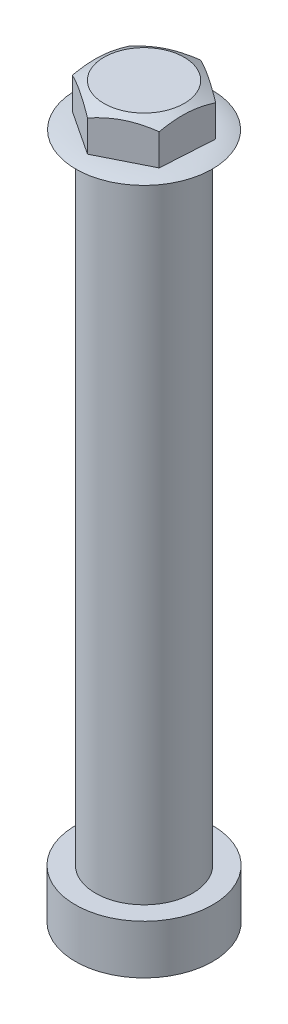
ISO-10303-21;
HEADER;
FILE_DESCRIPTION(('STEP AP214'),'2;1');
FILE_NAME('part.step','',(''),(''),'','','');
FILE_SCHEMA(('AUTOMOTIVE_DESIGN { 1 0 10303 214 1 1 1 1 }'));
ENDSEC;
DATA;
#1=APPLICATION_CONTEXT('core data for automotive mechanical design processes');
#2=APPLICATION_PROTOCOL_DEFINITION('international standard','automotive_design',2000,#1);
#3=PRODUCT_CONTEXT('',#1,'mechanical');
#4=PRODUCT('Part','Part','',(#3));
#5=PRODUCT_RELATED_PRODUCT_CATEGORY('part','',(#4));
#6=PRODUCT_DEFINITION_FORMATION('','',#4);
#7=PRODUCT_DEFINITION_CONTEXT('part definition',#1,'design');
#8=PRODUCT_DEFINITION('design','',#6,#7);
#9=PRODUCT_DEFINITION_SHAPE('','',#8);
#10=(LENGTH_UNIT() NAMED_UNIT(*) SI_UNIT(.MILLI.,.METRE.));
#11=(NAMED_UNIT(*) PLANE_ANGLE_UNIT() SI_UNIT($,.RADIAN.));
#12=(NAMED_UNIT(*) SI_UNIT($,.STERADIAN.) SOLID_ANGLE_UNIT());
#13=UNCERTAINTY_MEASURE_WITH_UNIT(LENGTH_MEASURE(1.E-05),#10,'distance_accuracy_value','');
#14=(GEOMETRIC_REPRESENTATION_CONTEXT(3) GLOBAL_UNCERTAINTY_ASSIGNED_CONTEXT((#13)) GLOBAL_UNIT_ASSIGNED_CONTEXT((#10,
#11,#12)) REPRESENTATION_CONTEXT('',''));
#15=CARTESIAN_POINT('',(0.,0.,0.));
#16=DIRECTION('',(0.,0.,1.));
#17=DIRECTION('',(1.,0.,0.));
#18=AXIS2_PLACEMENT_3D('',#15,#16,#17);
#19=CARTESIAN_POINT('',(0.,11.4007872176338,0.));
#20=DIRECTION('',(0.,-1.,0.));
#21=DIRECTION('',(0.,0.,-1.));
#22=AXIS2_PLACEMENT_3D('',#19,#20,#21);
#23=DEGENERATE_TOROIDAL_SURFACE('',#22,2.34284063875882,3.5316040570822,.T.);
#24=CARTESIAN_POINT('',(1.22850476517504,14.9321428571428,-2.04394333942399));
#25=CARTESIAN_POINT('',(1.23572012334002,14.9321428571428,-2.03960657654142));
#26=CARTESIAN_POINT('',(1.24291251573826,14.9321428571428,-2.03523160408168));
#27=CARTESIAN_POINT('',(1.25725056647514,14.9321428571428,-2.02640573739418));
#28=CARTESIAN_POINT('',(1.26439622481379,14.9321428571428,-2.02195484316642));
#29=CARTESIAN_POINT('',(1.2786400049054,14.9321428571428,-2.01297763032921));
#30=CARTESIAN_POINT('',(1.28573812665837,14.9321428571428,-2.00845131171975));
#31=CARTESIAN_POINT('',(1.2998860377958,14.9321428571428,-1.99932375825669));
#32=CARTESIAN_POINT('',(1.30693582718026,14.9321428571428,-1.99472252340308));
#33=CARTESIAN_POINT('',(1.32098628281266,14.9321428571428,-1.98544565333824));
#34=CARTESIAN_POINT('',(1.32798694906058,14.9321428571428,-1.98077001812701));
#35=CARTESIAN_POINT('',(1.34193837337303,14.9321428571428,-1.97134487189855));
#36=CARTESIAN_POINT('',(1.34888913143755,14.9321428571428,-1.96659536088132));
#37=CARTESIAN_POINT('',(1.36273995949248,14.9321428571428,-1.95702299524813));
#38=CARTESIAN_POINT('',(1.3696400294829,14.9321428571428,-1.95220014063216));
#39=CARTESIAN_POINT('',(1.38338870873702,14.9321428571428,-1.94248163043325));
#40=CARTESIAN_POINT('',(1.39023731800073,14.9321428571428,-1.93758597485032));
#41=CARTESIAN_POINT('',(1.39705981057478,14.9321428571428,-1.93265419009979));
#42=B_SPLINE_CURVE_WITH_KNOTS('',3,(#24,#25,#26,#27,#28,#29,#30,#31,#32,#33,#34,#35,#36,#37,#38,
#39,#40,#41),.UNSPECIFIED.,.F.,.F.,(4,2,2,2,2,2,2,2,4),(0.,0.0252549834235486,
0.0505099668470975,0.0757649502706464,0.101019933694195,0.126274917117744,0.151529900541293,
0.176784883964842,0.20203986738839),.UNSPECIFIED.);
#43=CARTESIAN_POINT('',(1.22850476517504,14.9321428571428,-2.04394333942399));
#44=VERTEX_POINT('',#43);
#45=CARTESIAN_POINT('',(1.39705981057478,14.9321428571428,-1.93265419009979));
#46=VERTEX_POINT('',#45);
#47=EDGE_CURVE('E185',#44,#46,#42,.T.);
#48=ORIENTED_EDGE('',*,*,#47,.T.);
#49=CARTESIAN_POINT('',(0.,14.9321428571428,0.));
#50=DIRECTION('',(0.,-1.,0.));
#51=DIRECTION('',(0.,0.,-1.));
#52=AXIS2_PLACEMENT_3D('',#49,#50,#51);
#53=CIRCLE('',#52,2.38472814652603);
#54=CARTESIAN_POINT('',(2.3843592384247,14.9321428571428,0.0419446655998146));
#55=VERTEX_POINT('',#54);
#56=EDGE_CURVE('E350',#46,#55,#53,.T.);
#57=ORIENTED_EDGE('',*,*,#56,.T.);
#58=CARTESIAN_POINT('',(2.3843592384247,14.9321428571428,0.0419446655998142));
#59=CARTESIAN_POINT('',(2.3842111706807,14.9321428571428,0.050361730509377));
#60=CARTESIAN_POINT('',(2.38401852958882,14.9321428571428,0.0587780112701052));
#61=CARTESIAN_POINT('',(2.38354413019547,14.9321428571428,0.0756080607927467));
#62=CARTESIAN_POINT('',(2.383262371894,14.9321428571428,0.0840218295546601));
#63=CARTESIAN_POINT('',(2.3826097675676,14.9321428571428,0.100845911378526));
#64=CARTESIAN_POINT('',(2.38223892154267,14.9321428571428,0.109256224440479));
#65=CARTESIAN_POINT('',(2.38140818393797,14.9321428571428,0.126072451627514));
#66=CARTESIAN_POINT('',(2.3809482923582,14.9321428571428,0.134478365752596));
#67=CARTESIAN_POINT('',(2.37993951503064,14.9321428571428,0.151284852297416));
#68=CARTESIAN_POINT('',(2.37939062928284,14.9321428571428,0.159685424717155));
#69=CARTESIAN_POINT('',(2.37820392537084,14.9321428571428,0.176480285704941));
#70=CARTESIAN_POINT('',(2.37756610720662,14.9321428571428,0.184874574272989));
#71=CARTESIAN_POINT('',(2.37620160942143,14.9321428571428,0.201655926048611));
#72=CARTESIAN_POINT('',(2.37547492980045,14.9321428571428,0.210042989256185));
#73=CARTESIAN_POINT('',(2.37393279270832,14.9321428571428,0.226808949858193));
#74=CARTESIAN_POINT('',(2.37311733523718,14.9321428571428,0.235187847252625));
#75=CARTESIAN_POINT('',(2.37225753064424,14.9321428571428,0.243562191514153));
#76=B_SPLINE_CURVE_WITH_KNOTS('',3,(#58,#59,#60,#61,#62,#63,#64,#65,#66,#67,#68,#69,#70,#71,#72,
#73,#74,#75),.UNSPECIFIED.,.F.,.F.,(4,2,2,2,2,2,2,2,4),(0.,0.025254983423552,0.0505099668471039,
0.0757649502706558,0.101019933694208,0.12627491711776,0.151529900541312,0.176784883964864,
0.202039867388415),.UNSPECIFIED.);
#77=CARTESIAN_POINT('',(2.37225753064424,14.9321428571428,0.243562191514153));
#78=VERTEX_POINT('',#77);
#79=EDGE_CURVE('E11',#55,#78,#76,.T.);
#80=ORIENTED_EDGE('',*,*,#79,.T.);
#81=CARTESIAN_POINT('',(1.15585447324965,14.9321428571428,2.08588800502382));
#82=VERTEX_POINT('',#81);
#83=EDGE_CURVE('E355',#78,#82,#53,.T.);
#84=ORIENTED_EDGE('',*,*,#83,.T.);
#85=CARTESIAN_POINT('',(1.15585447324965,14.9321428571428,2.08588800502382));
#86=CARTESIAN_POINT('',(1.14849104734067,14.9321428571428,2.08996830705082));
#87=CARTESIAN_POINT('',(1.14110601385056,14.9321428571428,2.0940096153518));
#88=CARTESIAN_POINT('',(1.12629356372033,14.9321428571428,2.10201379818694));
#89=CARTESIAN_POINT('',(1.11886614708021,14.9321428571428,2.10597667272109));
#90=CARTESIAN_POINT('',(1.10396976266219,14.9321428571428,2.11382354170774));
#91=CARTESIAN_POINT('',(1.0965007948843,14.9321428571428,2.11770753616024));
#92=CARTESIAN_POINT('',(1.08152214614217,14.9321428571428,2.1253962098842));
#93=CARTESIAN_POINT('',(1.07401246517793,14.9321428571428,2.12920088915568));
#94=CARTESIAN_POINT('',(1.05895323221798,14.9321428571428,2.13673050563566));
#95=CARTESIAN_POINT('',(1.05140368022226,14.9321428571428,2.14045544284416));
#96=CARTESIAN_POINT('',(1.03626555199781,14.9321428571428,2.14782515760349));
#97=CARTESIAN_POINT('',(1.02867697576908,14.9321428571428,2.1514699351543));
#98=CARTESIAN_POINT('',(1.01346164992895,14.9321428571428,2.15867892129673));
#99=CARTESIAN_POINT('',(1.00583490031756,14.9321428571428,2.16224312988833));
#100=CARTESIAN_POINT('',(0.990544083971311,14.9321428571428,2.16929058029143));
#101=CARTESIAN_POINT('',(0.982880017236457,14.9321428571428,2.17277382210293));
#102=CARTESIAN_POINT('',(0.975197720069472,14.9321428571428,2.17621638161392));
#103=B_SPLINE_CURVE_WITH_KNOTS('',3,(#85,#86,#87,#88,#89,#90,#91,#92,#93,#94,#95,#96,#97,#98,
#99,#100,#101,#102),.UNSPECIFIED.,.F.,.F.,(4,2,2,2,2,2,2,2,4),(0.,0.0252549834235468,
0.0505099668470941,0.0757649502706398,0.101019933694188,0.126274917117734,0.15152990054128,
0.176784883964827,0.202039867388374),.UNSPECIFIED.);
#104=CARTESIAN_POINT('',(0.975197720069473,14.9321428571428,2.17621638161392));
#105=VERTEX_POINT('',#104);
#106=EDGE_CURVE('E49',#82,#105,#103,.T.);
#107=ORIENTED_EDGE('',*,*,#106,.T.);
#108=CARTESIAN_POINT('',(-1.22850476517503,14.9321428571428,2.043943339424));
#109=VERTEX_POINT('',#108);
#110=EDGE_CURVE('E375',#105,#109,#53,.T.);
#111=ORIENTED_EDGE('',*,*,#110,.T.);
#112=CARTESIAN_POINT('',(-1.22850476517503,14.9321428571428,2.043943339424));
#113=CARTESIAN_POINT('',(-1.23572012334001,14.9321428571428,2.03960657654143));
#114=CARTESIAN_POINT('',(-1.24291251573825,14.9321428571428,2.03523160408169));
#115=CARTESIAN_POINT('',(-1.25725056647513,14.9321428571428,2.02640573739419));
#116=CARTESIAN_POINT('',(-1.26439622481378,14.9321428571428,2.02195484316643));
#117=CARTESIAN_POINT('',(-1.27864000490539,14.9321428571428,2.01297763032921));
#118=CARTESIAN_POINT('',(-1.28573812665836,14.9321428571428,2.00845131171976));
#119=CARTESIAN_POINT('',(-1.2998860377958,14.9321428571428,1.99932375825669));
#120=CARTESIAN_POINT('',(-1.30693582718026,14.9321428571428,1.99472252340308));
#121=CARTESIAN_POINT('',(-1.32098628281266,14.9321428571428,1.98544565333824));
#122=CARTESIAN_POINT('',(-1.32798694906058,14.9321428571428,1.98077001812701));
#123=CARTESIAN_POINT('',(-1.34193837337303,14.9321428571428,1.97134487189855));
#124=CARTESIAN_POINT('',(-1.34888913143755,14.9321428571428,1.96659536088132));
#125=CARTESIAN_POINT('',(-1.36273995949249,14.9321428571428,1.95702299524812));
#126=CARTESIAN_POINT('',(-1.3696400294829,14.9321428571428,1.95220014063215));
#127=CARTESIAN_POINT('',(-1.38338870873703,14.9321428571428,1.94248163043325));
#128=CARTESIAN_POINT('',(-1.39023731800073,14.9321428571428,1.93758597485031));
#129=CARTESIAN_POINT('',(-1.39705981057479,14.9321428571428,1.93265419009978));
#130=B_SPLINE_CURVE_WITH_KNOTS('',3,(#112,#113,#114,#115,#116,#117,#118,#119,#120,#121,#122,
#123,#124,#125,#126,#127,#128,#129),.UNSPECIFIED.,.F.,.F.,(4,2,2,2,2,2,2,2,4),(0.,
0.025254983423552,0.0505099668471039,0.0757649502706559,0.101019933694208,0.12627491711776,
0.151529900541312,0.176784883964864,0.202039867388416),.UNSPECIFIED.);
#131=CARTESIAN_POINT('',(-1.39705981057479,14.9321428571428,1.93265419009978));
#132=VERTEX_POINT('',#131);
#133=EDGE_CURVE('E385',#109,#132,#130,.T.);
#134=ORIENTED_EDGE('',*,*,#133,.T.);
#135=CARTESIAN_POINT('',(-2.3843592384247,14.9321428571428,-0.0419446655998146));
#136=VERTEX_POINT('',#135);
#137=EDGE_CURVE('E371',#132,#136,#53,.T.);
#138=ORIENTED_EDGE('',*,*,#137,.T.);
#139=CARTESIAN_POINT('',(-2.3843592384247,14.9321428571428,-0.0419446655998134));
#140=CARTESIAN_POINT('',(-2.3842111706807,14.9321428571428,-0.0503617305093765));
#141=CARTESIAN_POINT('',(-2.38401852958882,14.9321428571428,-0.0587780112701051));
#142=CARTESIAN_POINT('',(-2.38354413019547,14.9321428571428,-0.0756080607927466));
#143=CARTESIAN_POINT('',(-2.383262371894,14.9321428571428,-0.0840218295546596));
#144=CARTESIAN_POINT('',(-2.3826097675676,14.9321428571428,-0.100845911378525));
#145=CARTESIAN_POINT('',(-2.38223892154267,14.9321428571428,-0.109256224440477));
#146=CARTESIAN_POINT('',(-2.38140818393797,14.9321428571428,-0.126072451627512));
#147=CARTESIAN_POINT('',(-2.3809482923582,14.9321428571428,-0.134478365752595));
#148=CARTESIAN_POINT('',(-2.37993951503064,14.9321428571428,-0.151284852297416));
#149=CARTESIAN_POINT('',(-2.37939062928284,14.9321428571428,-0.159685424717155));
#150=CARTESIAN_POINT('',(-2.37820392537084,14.9321428571428,-0.176480285704941));
#151=CARTESIAN_POINT('',(-2.37756610720662,14.9321428571428,-0.184874574272988));
#152=CARTESIAN_POINT('',(-2.37620160942143,14.9321428571428,-0.20165592604861));
#153=CARTESIAN_POINT('',(-2.37547492980045,14.9321428571428,-0.210042989256184));
#154=CARTESIAN_POINT('',(-2.37393279270832,14.9321428571428,-0.226808949858191));
#155=CARTESIAN_POINT('',(-2.37311733523718,14.9321428571428,-0.235187847252624));
#156=CARTESIAN_POINT('',(-2.37225753064424,14.9321428571428,-0.243562191514152));
#157=B_SPLINE_CURVE_WITH_KNOTS('',3,(#139,#140,#141,#142,#143,#144,#145,#146,#147,#148,#149,
#150,#151,#152,#153,#154,#155,#156),.UNSPECIFIED.,.F.,.F.,(4,2,2,2,2,2,2,2,4),(0.,
0.025254983423553,0.0505099668471039,0.0757649502706548,0.101019933694208,0.126274917117761,
0.151529900541312,0.176784883964862,0.202039867388415),.UNSPECIFIED.);
#158=CARTESIAN_POINT('',(-2.37225753064424,14.9321428571428,-0.243562191514153));
#159=VERTEX_POINT('',#158);
#160=EDGE_CURVE('E397',#136,#159,#157,.T.);
#161=ORIENTED_EDGE('',*,*,#160,.T.);
#162=CARTESIAN_POINT('',(-1.15585447324967,14.9321428571428,-2.08588800502381));
#163=VERTEX_POINT('',#162);
#164=EDGE_CURVE('E367',#159,#163,#53,.T.);
#165=ORIENTED_EDGE('',*,*,#164,.T.);
#166=CARTESIAN_POINT('',(-1.15585447324967,14.9321428571428,-2.08588800502381));
#167=CARTESIAN_POINT('',(-1.14849104734068,14.9321428571428,-2.08996830705081));
#168=CARTESIAN_POINT('',(-1.14110601385057,14.9321428571428,-2.0940096153518));
#169=CARTESIAN_POINT('',(-1.12629356372034,14.9321428571428,-2.10201379818694));
#170=CARTESIAN_POINT('',(-1.11886614708022,14.9321428571428,-2.10597667272109));
#171=CARTESIAN_POINT('',(-1.1039697626622,14.9321428571428,-2.11382354170774));
#172=CARTESIAN_POINT('',(-1.09650079488431,14.9321428571428,-2.11770753616023));
#173=CARTESIAN_POINT('',(-1.08152214614217,14.9321428571428,-2.1253962098842));
#174=CARTESIAN_POINT('',(-1.07401246517794,14.9321428571428,-2.12920088915568));
#175=CARTESIAN_POINT('',(-1.05895323221798,14.9321428571428,-2.13673050563566));
#176=CARTESIAN_POINT('',(-1.05140368022226,14.9321428571428,-2.14045544284416));
#177=CARTESIAN_POINT('',(-1.0362655519978,14.9321428571428,-2.14782515760349));
#178=CARTESIAN_POINT('',(-1.02867697576907,14.9321428571428,-2.15146993515431));
#179=CARTESIAN_POINT('',(-1.01346164992894,14.9321428571428,-2.15867892129673));
#180=CARTESIAN_POINT('',(-1.00583490031755,14.9321428571428,-2.16224312988834));
#181=CARTESIAN_POINT('',(-0.990544083971295,14.9321428571428,-2.16929058029144));
#182=CARTESIAN_POINT('',(-0.982880017236439,14.9321428571428,-2.17277382210294));
#183=CARTESIAN_POINT('',(-0.975197720069453,14.9321428571428,-2.17621638161393));
#184=B_SPLINE_CURVE_WITH_KNOTS('',3,(#166,#167,#168,#169,#170,#171,#172,#173,#174,#175,#176,
#177,#178,#179,#180,#181,#182,#183),.UNSPECIFIED.,.F.,.F.,(4,2,2,2,2,2,2,2,4),(0.,
0.0252549834235509,0.0505099668471038,0.0757649502706546,0.101019933694208,0.126274917117761,
0.151529900541312,0.176784883964864,0.202039867388415),.UNSPECIFIED.);
#185=CARTESIAN_POINT('',(-0.975197720069453,14.9321428571428,-2.17621638161393));
#186=VERTEX_POINT('',#185);
#187=EDGE_CURVE('E344',#163,#186,#184,.T.);
#188=ORIENTED_EDGE('',*,*,#187,.T.);
#189=EDGE_CURVE('E181',#186,#44,#53,.T.);
#190=ORIENTED_EDGE('',*,*,#189,.T.);
#191=EDGE_LOOP('',(#48,#57,#80,#84,#107,#111,#134,#138,#161,#165,#188,#190));
#192=FACE_BOUND('',#191,.T.);
#193=CARTESIAN_POINT('',(0.,14.7321428571428,0.));
#194=DIRECTION('',(0.,-1.,0.));
#195=DIRECTION('',(0.,0.,-1.));
#196=AXIS2_PLACEMENT_3D('',#193,#194,#195);
#197=CIRCLE('',#196,3.51514470303165);
#198=CARTESIAN_POINT('',(0.,14.7321428571428,-3.51514470303165));
#199=VERTEX_POINT('',#198);
#200=EDGE_CURVE('E338',#199,#199,#197,.T.);
#201=ORIENTED_EDGE('',*,*,#200,.F.);
#202=EDGE_LOOP('',(#201));
#203=FACE_BOUND('',#202,.T.);
#204=ADVANCED_FACE('F39',(#192,#203),#23,.T.);
#205=CARTESIAN_POINT('',(2.5,14.7321428571428,0.));
#206=DIRECTION('',(0.,-1.,0.));
#207=DIRECTION('',(0.,0.,-1.));
#208=AXIS2_PLACEMENT_3D('',#205,#206,#207);
#209=PLANE('',#208);
#210=ORIENTED_EDGE('',*,*,#200,.T.);
#211=EDGE_LOOP('',(#210));
#212=FACE_BOUND('',#211,.T.);
#213=CARTESIAN_POINT('',(0.,14.7321428571428,0.));
#214=DIRECTION('',(0.,-1.,0.));
#215=DIRECTION('',(0.,0.,-1.));
#216=AXIS2_PLACEMENT_3D('',#213,#214,#215);
#217=CIRCLE('',#216,2.5);
#218=CARTESIAN_POINT('',(0.,14.7321428571428,-2.5));
#219=VERTEX_POINT('',#218);
#220=EDGE_CURVE('E340',#219,#219,#217,.T.);
#221=ORIENTED_EDGE('',*,*,#220,.F.);
#222=EDGE_LOOP('',(#221));
#223=FACE_BOUND('',#222,.T.);
#224=ADVANCED_FACE('F326',(#212,#223),#209,.T.);
#225=CARTESIAN_POINT('',(0.,0.,0.));
#226=DIRECTION('',(0.,-1.,0.));
#227=DIRECTION('',(0.,0.,-1.));
#228=AXIS2_PLACEMENT_3D('',#225,#226,#227);
#229=CYLINDRICAL_SURFACE('',#228,2.5);
#230=ORIENTED_EDGE('',*,*,#220,.T.);
#231=EDGE_LOOP('',(#230));
#232=FACE_BOUND('',#231,.T.);
#233=CARTESIAN_POINT('',(0.,-18.0678571428572,0.));
#234=DIRECTION('',(0.,-1.,0.));
#235=DIRECTION('',(0.,0.,-1.));
#236=AXIS2_PLACEMENT_3D('',#233,#234,#235);
#237=CIRCLE('',#236,2.5);
#238=CARTESIAN_POINT('',(0.,-18.0678571428572,-2.5));
#239=VERTEX_POINT('',#238);
#240=EDGE_CURVE('E346',#239,#239,#237,.T.);
#241=ORIENTED_EDGE('',*,*,#240,.F.);
#242=EDGE_LOOP('',(#241));
#243=FACE_BOUND('',#242,.T.);
#244=ADVANCED_FACE('F331',(#232,#243),#229,.T.);
#245=CARTESIAN_POINT('',(2.5,-18.0678571428572,0.));
#246=DIRECTION('',(0.,1.,0.));
#247=DIRECTION('',(0.,0.,1.));
#248=AXIS2_PLACEMENT_3D('',#245,#246,#247);
#249=PLANE('',#248);
#250=ORIENTED_EDGE('',*,*,#240,.T.);
#251=EDGE_LOOP('',(#250));
#252=FACE_BOUND('',#251,.T.);
#253=CARTESIAN_POINT('',(0.,-18.0678571428572,0.));
#254=DIRECTION('',(0.,-1.,0.));
#255=DIRECTION('',(0.,0.,-1.));
#256=AXIS2_PLACEMENT_3D('',#253,#254,#255);
#257=CIRCLE('',#256,3.53602296334848);
#258=CARTESIAN_POINT('',(0.,-18.0678571428572,-3.53602296334848));
#259=VERTEX_POINT('',#258);
#260=EDGE_CURVE('E461',#259,#259,#257,.T.);
#261=ORIENTED_EDGE('',*,*,#260,.F.);
#262=EDGE_LOOP('',(#261));
#263=FACE_BOUND('',#262,.T.);
#264=ADVANCED_FACE('F468',(#252,#263),#249,.T.);
#265=CARTESIAN_POINT('',(0.,0.,0.));
#266=DIRECTION('',(0.,-1.,0.));
#267=DIRECTION('',(0.,0.,-1.));
#268=AXIS2_PLACEMENT_3D('',#265,#266,#267);
#269=CYLINDRICAL_SURFACE('',#268,3.53602296334848);
#270=ORIENTED_EDGE('',*,*,#260,.T.);
#271=EDGE_LOOP('',(#270));
#272=FACE_BOUND('',#271,.T.);
#273=CARTESIAN_POINT('',(0.,-20.5964207435835,0.));
#274=DIRECTION('',(0.,-1.,0.));
#275=DIRECTION('',(0.,0.,-1.));
#276=AXIS2_PLACEMENT_3D('',#273,#274,#275);
#277=CIRCLE('',#276,3.53602296334848);
#278=CARTESIAN_POINT('',(0.,-20.5964207435835,-3.53602296334848));
#279=VERTEX_POINT('',#278);
#280=EDGE_CURVE('E457',#279,#279,#277,.T.);
#281=ORIENTED_EDGE('',*,*,#280,.F.);
#282=EDGE_LOOP('',(#281));
#283=FACE_BOUND('',#282,.T.);
#284=ADVANCED_FACE('F477',(#272,#283),#269,.T.);
#285=CARTESIAN_POINT('',(3.53602296334848,-20.5964207435835,0.));
#286=DIRECTION('',(0.,-1.,0.));
#287=DIRECTION('',(0.,0.,-1.));
#288=AXIS2_PLACEMENT_3D('',#285,#286,#287);
#289=PLANE('',#288);
#290=ORIENTED_EDGE('',*,*,#280,.T.);
#291=EDGE_LOOP('',(#290));
#292=FACE_BOUND('',#291,.T.);
#293=CARTESIAN_POINT('',(0.,-20.5964207435835,0.));
#294=DIRECTION('',(0.,-1.,0.));
#295=DIRECTION('',(0.,0.,-1.));
#296=AXIS2_PLACEMENT_3D('',#293,#294,#295);
#297=CIRCLE('',#296,1.16788134129855);
#298=CARTESIAN_POINT('',(0.,-20.5964207435835,-1.16788134129855));
#299=VERTEX_POINT('',#298);
#300=EDGE_CURVE('E453',#299,#299,#297,.T.);
#301=ORIENTED_EDGE('',*,*,#300,.F.);
#302=EDGE_LOOP('',(#301));
#303=FACE_BOUND('',#302,.T.);
#304=ADVANCED_FACE('F482',(#292,#303),#289,.T.);
#305=CARTESIAN_POINT('',(0.,0.,0.));
#306=DIRECTION('',(0.,-1.,0.));
#307=DIRECTION('',(0.,0.,-1.));
#308=AXIS2_PLACEMENT_3D('',#305,#306,#307);
#309=CYLINDRICAL_SURFACE('',#308,1.16788134129855);
#310=ORIENTED_EDGE('',*,*,#300,.T.);
#311=EDGE_LOOP('',(#310));
#312=FACE_BOUND('',#311,.T.);
#313=CARTESIAN_POINT('',(0.,-18.729405275402,0.));
#314=DIRECTION('',(0.,-1.,0.));
#315=DIRECTION('',(0.,0.,-1.));
#316=AXIS2_PLACEMENT_3D('',#313,#314,#315);
#317=CIRCLE('',#316,1.16788134129855);
#318=CARTESIAN_POINT('',(0.,-18.729405275402,-1.16788134129855));
#319=VERTEX_POINT('',#318);
#320=EDGE_CURVE('E354',#319,#319,#317,.T.);
#321=ORIENTED_EDGE('',*,*,#320,.F.);
#322=EDGE_LOOP('',(#321));
#323=FACE_BOUND('',#322,.T.);
#324=ADVANCED_FACE('F486',(#312,#323),#309,.F.);
#325=CARTESIAN_POINT('',(0.,-17.5656157835472,0.));
#326=DIRECTION('',(0.,-1.,0.));
#327=DIRECTION('',(0.,0.,-1.));
#328=AXIS2_PLACEMENT_3D('',#325,#326,#327);
#329=CONICAL_SURFACE('',#328,0.,0.787153061724035);
#330=ORIENTED_EDGE('',*,*,#320,.T.);
#331=EDGE_LOOP('',(#330));
#332=FACE_BOUND('',#331,.T.);
#333=CARTESIAN_POINT('',(0.,-17.5656157835472,0.));
#334=VERTEX_POINT('',#333);
#335=VERTEX_LOOP('',#334);
#336=FACE_BOUND('',#335,.T.);
#337=ADVANCED_FACE('F320',(#332,#336),#329,.F.);
#338=CARTESIAN_POINT('',(0.,14.9321428571428,0.));
#339=DIRECTION('',(0.,1.,0.));
#340=DIRECTION('',(0.,0.,1.));
#341=AXIS2_PLACEMENT_3D('',#338,#339,#340);
#342=PLANE('',#341);
#343=ORIENTED_EDGE('',*,*,#56,.F.);
#344=DIRECTION('',(-0.834511930120725,0.,-0.550989871491465));
#345=VECTOR('',#344,1.);
#346=CARTESIAN_POINT('',(2.46072711493959,14.9321428571428,-1.23036355746994));
#347=LINE('',#346,#345);
#348=CARTESIAN_POINT('',(2.46072711493959,14.9321428571428,-1.23036355746994));
#349=VERTEX_POINT('',#348);
#350=EDGE_CURVE('E64',#349,#46,#347,.T.);
#351=ORIENTED_EDGE('',*,*,#350,.F.);
#352=DIRECTION('',(0.0599152608791697,0.,-0.998203466991465));
#353=VECTOR('',#352,1.);
#354=CARTESIAN_POINT('',(2.29588965412935,14.9321428571428,1.51587041458391));
#355=LINE('',#354,#353);
#356=EDGE_CURVE('E150',#55,#349,#355,.T.);
#357=ORIENTED_EDGE('',*,*,#356,.F.);
#358=EDGE_LOOP('',(#343,#351,#357));
#359=FACE_BOUND('',#358,.T.);
#360=ADVANCED_FACE('F314',(#359),#342,.F.);
#361=ORIENTED_EDGE('',*,*,#83,.F.);
#362=CARTESIAN_POINT('',(2.29588965412935,14.9321428571428,1.51587041458391));
#363=VERTEX_POINT('',#362);
#364=EDGE_CURVE('E434',#363,#78,#355,.T.);
#365=ORIENTED_EDGE('',*,*,#364,.F.);
#366=DIRECTION('',(0.894427190999895,0.,-0.4472135955));
#367=VECTOR('',#366,1.);
#368=CARTESIAN_POINT('',(-0.164837460810232,14.9321428571428,2.74623397205384));
#369=LINE('',#368,#367);
#370=EDGE_CURVE('E155',#82,#363,#369,.T.);
#371=ORIENTED_EDGE('',*,*,#370,.F.);
#372=EDGE_LOOP('',(#361,#365,#371));
#373=FACE_BOUND('',#372,.T.);
#374=ADVANCED_FACE('F319',(#373),#342,.F.);
#375=ORIENTED_EDGE('',*,*,#110,.F.);
#376=CARTESIAN_POINT('',(-0.164837460810232,14.9321428571428,2.74623397205384));
#377=VERTEX_POINT('',#376);
#378=EDGE_CURVE('E159',#377,#105,#369,.T.);
#379=ORIENTED_EDGE('',*,*,#378,.F.);
#380=DIRECTION('',(0.834511930120725,0.,0.550989871491466));
#381=VECTOR('',#380,1.);
#382=CARTESIAN_POINT('',(-2.46072711493959,14.9321428571428,1.23036355746994));
#383=LINE('',#382,#381);
#384=EDGE_CURVE('E282',#109,#377,#383,.T.);
#385=ORIENTED_EDGE('',*,*,#384,.F.);
#386=EDGE_LOOP('',(#375,#379,#385));
#387=FACE_BOUND('',#386,.T.);
#388=ADVANCED_FACE('F509',(#387),#342,.F.);
#389=ORIENTED_EDGE('',*,*,#137,.F.);
#390=CARTESIAN_POINT('',(-2.46072711493959,14.9321428571428,1.23036355746994));
#391=VERTEX_POINT('',#390);
#392=EDGE_CURVE('E292',#391,#132,#383,.T.);
#393=ORIENTED_EDGE('',*,*,#392,.F.);
#394=DIRECTION('',(-0.0599152608791697,0.,0.998203466991465));
#395=VECTOR('',#394,1.);
#396=CARTESIAN_POINT('',(-2.29588965412935,14.9321428571428,-1.5158704145839));
#397=LINE('',#396,#395);
#398=EDGE_CURVE('E283',#136,#391,#397,.T.);
#399=ORIENTED_EDGE('',*,*,#398,.F.);
#400=EDGE_LOOP('',(#389,#393,#399));
#401=FACE_BOUND('',#400,.T.);
#402=ADVANCED_FACE('F323',(#401),#342,.F.);
#403=ORIENTED_EDGE('',*,*,#164,.F.);
#404=CARTESIAN_POINT('',(-2.29588965412935,14.9321428571428,-1.5158704145839));
#405=VERTEX_POINT('',#404);
#406=EDGE_CURVE('E272',#405,#159,#397,.T.);
#407=ORIENTED_EDGE('',*,*,#406,.F.);
#408=DIRECTION('',(-0.894427190999895,0.,0.4472135955));
#409=VECTOR('',#408,1.);
#410=CARTESIAN_POINT('',(0.164837460810233,14.9321428571428,-2.74623397205384));
#411=LINE('',#410,#409);
#412=EDGE_CURVE('E416',#163,#405,#411,.T.);
#413=ORIENTED_EDGE('',*,*,#412,.F.);
#414=EDGE_LOOP('',(#403,#407,#413));
#415=FACE_BOUND('',#414,.T.);
#416=ADVANCED_FACE('F315',(#415),#342,.F.);
#417=CARTESIAN_POINT('',(2.29588965412935,16.9321428571428,1.51587041458391));
#418=DIRECTION('',(-0.998203466991465,0.,-0.0599152608791697));
#419=DIRECTION('',(-0.0599152608791697,0.,0.998203466991465));
#420=AXIS2_PLACEMENT_3D('',#417,#418,#419);
#421=PLANE('',#420);
#422=DIRECTION('',(0.,-1.,0.));
#423=VECTOR('',#422,1.);
#424=CARTESIAN_POINT('',(2.46072711493959,16.9321428571428,-1.23036355746994));
#425=LINE('',#424,#423);
#426=CARTESIAN_POINT('',(2.46072711493959,16.548897812025,-1.23036355746994));
#427=VERTEX_POINT('',#426);
#428=EDGE_CURVE('E148',#427,#349,#425,.T.);
#429=ORIENTED_EDGE('',*,*,#428,.F.);
#430=CARTESIAN_POINT('',(2.46074062013582,16.5488348896727,-1.23058855746994));
#431=CARTESIAN_POINT('',(2.45351773846385,16.5824995592111,-1.11025351392965));
#432=CARTESIAN_POINT('',(2.44623656720168,16.6131060458605,-0.988947351008785));
#433=CARTESIAN_POINT('',(2.43155665401806,16.6665431283379,-0.744376268115911));
#434=CARTESIAN_POINT('',(2.42415768737687,16.6893563481994,-0.621107604256018));
#435=CARTESIAN_POINT('',(2.40944542423664,16.7249663791817,-0.375997562868022));
#436=CARTESIAN_POINT('',(2.40213410317757,16.7379826147535,-0.254189096671587));
#437=CARTESIAN_POINT('',(2.3874787329988,16.7536496113539,-0.010026906474475));
#438=CARTESIAN_POINT('',(2.38013473007279,16.7563120425379,0.112326047927611));
#439=CARTESIAN_POINT('',(2.36635881858302,16.7513680119346,0.341836232950327));
#440=CARTESIAN_POINT('',(2.3599252004034,16.7449775384176,0.449021946205315));
#441=CARTESIAN_POINT('',(2.34709701847895,16.7245243463655,0.662742715910516));
#442=CARTESIAN_POINT('',(2.3407024931917,16.7104550172392,0.769277131647561));
#443=CARTESIAN_POINT('',(2.32784900808918,16.6752069801691,0.98341945872739));
#444=CARTESIAN_POINT('',(2.32139148473815,16.653886155346,1.09100343821094));
#445=CARTESIAN_POINT('',(2.30856705489035,16.6054276250369,1.304661697366));
#446=CARTESIAN_POINT('',(2.30220000436534,16.578300620446,1.41073837658452));
#447=CARTESIAN_POINT('',(2.29587614893313,16.5488348896727,1.51609541458391));
#448=B_SPLINE_CURVE_WITH_KNOTS('',3,(#430,#431,#432,#433,#434,#435,#436,#437,#438,#439,#440,
#441,#442,#443,#444,#445,#446,#447),.UNSPECIFIED.,.F.,.F.,(4,2,2,2,2,2,2,2,4),(0.,
0.375625839130045,0.752083794239729,1.11983638075704,1.48717433940027,1.80958971439268,
2.13228308989451,2.4617047501517,2.79052442924564),.UNSPECIFIED.);
#449=CARTESIAN_POINT('',(2.29588965412935,16.548897812025,1.51587041458391));
#450=VERTEX_POINT('',#449);
#451=EDGE_CURVE('E134',#427,#450,#448,.T.);
#452=ORIENTED_EDGE('',*,*,#451,.T.);
#453=DIRECTION('',(0.,-1.,0.));
#454=VECTOR('',#453,1.);
#455=CARTESIAN_POINT('',(2.29588965412935,16.9321428571428,1.51587041458391));
#456=LINE('',#455,#454);
#457=EDGE_CURVE('E145',#450,#363,#456,.T.);
#458=ORIENTED_EDGE('',*,*,#457,.T.);
#459=ORIENTED_EDGE('',*,*,#364,.T.);
#460=ORIENTED_EDGE('',*,*,#79,.F.);
#461=ORIENTED_EDGE('',*,*,#356,.T.);
#462=EDGE_LOOP('',(#429,#452,#458,#459,#460,#461));
#463=FACE_BOUND('',#462,.T.);
#464=ADVANCED_FACE('F143',(#463),#421,.F.);
#465=CARTESIAN_POINT('',(2.46072711493959,16.9321428571428,-1.23036355746994));
#466=DIRECTION('',(-0.550989871491465,0.,0.834511930120725));
#467=DIRECTION('',(0.834511930120725,0.,0.550989871491465));
#468=AXIS2_PLACEMENT_3D('',#465,#466,#467);
#469=PLANE('',#468);
#470=DIRECTION('',(0.,-1.,0.));
#471=VECTOR('',#470,1.);
#472=CARTESIAN_POINT('',(0.164837460810233,16.9321428571428,-2.74623397205384));
#473=LINE('',#472,#471);
#474=CARTESIAN_POINT('',(0.164837460810233,16.548897812025,-2.74623397205384));
#475=VERTEX_POINT('',#474);
#476=CARTESIAN_POINT('',(0.164837460810233,14.9321428571428,-2.74623397205384));
#477=VERTEX_POINT('',#476);
#478=EDGE_CURVE('E176',#475,#477,#473,.T.);
#479=ORIENTED_EDGE('',*,*,#478,.F.);
#480=CARTESIAN_POINT('',(0.164612460810233,16.5488225463938,-2.74638252921236));
#481=CARTESIAN_POINT('',(0.265214857842401,16.5824882310912,-2.67995939035505));
#482=CARTESIAN_POINT('',(0.366629128392834,16.6130957938479,-2.61300020872909));
#483=CARTESIAN_POINT('',(0.571095274881091,16.6665351053309,-2.47800060990775));
#484=CARTESIAN_POINT('',(0.674150281101777,16.6893494768121,-2.40995812593047));
#485=CARTESIAN_POINT('',(0.879067036635421,16.7249617842721,-2.27466101066743));
#486=CARTESIAN_POINT('',(0.980901269234312,16.7379791512476,-2.20742454740323));
#487=CARTESIAN_POINT('',(1.18502564826106,16.7536483335288,-2.07265060192835));
#488=CARTESIAN_POINT('',(1.28731515116313,16.7563118198308,-2.00511354460817));
#489=CARTESIAN_POINT('',(1.47919507451841,16.7513694723044,-1.87842405043159));
#490=CARTESIAN_POINT('',(1.56880928991213,16.7449792138229,-1.81925590286964));
#491=CARTESIAN_POINT('',(1.74749372198435,16.7245254803085,-1.70127878509403));
#492=CARTESIAN_POINT('',(1.83656340286656,16.7104553926169,-1.64247016864205));
#493=CARTESIAN_POINT('',(2.015600368112,16.675204978537,-1.52426028941536));
#494=CARTESIAN_POINT('',(2.10554764084326,16.6538825061975,-1.46487223940146));
#495=CARTESIAN_POINT('',(2.28417987817075,16.6054200477468,-1.34692958341682));
#496=CARTESIAN_POINT('',(2.37286684940766,16.578290765456,-1.28837365255347));
#497=CARTESIAN_POINT('',(2.46095211493959,16.5488225463938,-1.23021500031142));
#498=B_SPLINE_CURVE_WITH_KNOTS('',3,(#480,#481,#482,#483,#484,#485,#486,#487,#488,#489,#490,
#491,#492,#493,#494,#495,#496,#497),.UNSPECIFIED.,.F.,.F.,(4,2,2,2,2,2,2,2,4),(0.,
0.375628854657246,0.752089900504497,1.11984523143295,1.4871859045232,1.80962082527482,
2.13233381513885,2.46177606628871,2.79061620013184),.UNSPECIFIED.);
#499=EDGE_CURVE('E151',#475,#427,#498,.T.);
#500=ORIENTED_EDGE('',*,*,#499,.T.);
#501=ORIENTED_EDGE('',*,*,#428,.T.);
#502=ORIENTED_EDGE('',*,*,#350,.T.);
#503=ORIENTED_EDGE('',*,*,#47,.F.);
#504=EDGE_CURVE('E421',#44,#477,#347,.T.);
#505=ORIENTED_EDGE('',*,*,#504,.T.);
#506=EDGE_LOOP('',(#479,#500,#501,#502,#503,#505));
#507=FACE_BOUND('',#506,.T.);
#508=ADVANCED_FACE('F193',(#507),#469,.F.);
#509=CARTESIAN_POINT('',(0.164837460810233,16.9321428571428,-2.74623397205384));
#510=DIRECTION('',(0.4472135955,0.,0.894427190999895));
#511=DIRECTION('',(0.894427190999895,0.,-0.4472135955));
#512=AXIS2_PLACEMENT_3D('',#509,#510,#511);
#513=PLANE('',#512);
#514=DIRECTION('',(0.,-1.,0.));
#515=VECTOR('',#514,1.);
#516=CARTESIAN_POINT('',(-2.29588965412935,16.9321428571428,-1.5158704145839));
#517=LINE('',#516,#515);
#518=CARTESIAN_POINT('',(-2.29588965412935,16.548897812025,-1.5158704145839));
#519=VERTEX_POINT('',#518);
#520=EDGE_CURVE('E173',#519,#405,#517,.T.);
#521=ORIENTED_EDGE('',*,*,#520,.F.);
#522=CARTESIAN_POINT('',(-2.29611465412935,16.5488275885808,-1.5157579145839));
#523=CARTESIAN_POINT('',(-2.18828960719348,16.5824928585926,-1.56967043805185));
#524=CARTESIAN_POINT('',(-2.07959439870813,16.6130999817669,-1.62401804229453));
#525=CARTESIAN_POINT('',(-1.86044882668239,16.666538382716,-1.73359082830741));
#526=CARTESIAN_POINT('',(-1.74999510826411,16.689352283768,-1.78881768751656));
#527=CARTESIAN_POINT('',(-1.53036658904941,16.7249636613013,-1.89863194712392));
#528=CARTESIAN_POINT('',(-1.42122127953413,16.7379805661053,-1.95320460188157));
#529=CARTESIAN_POINT('',(-1.20244204450993,16.7536488555484,-2.06259421939368));
#530=CARTESIAN_POINT('',(-1.09280880867265,16.7563119108403,-2.11741083731233));
#531=CARTESIAN_POINT('',(-0.887155253594545,16.7513688757741,-2.22023761485139));
#532=CARTESIAN_POINT('',(-0.791109423598891,16.7449785294429,-2.26826052984922));
#533=CARTESIAN_POINT('',(-0.59960080189342,16.7245250171019,-2.36401484070197));
#534=CARTESIAN_POINT('',(-0.504138584382132,16.7104552392781,-2.41174594945762));
#535=CARTESIAN_POINT('',(-0.312252164894284,16.6752057961946,-2.50768915920155));
#536=CARTESIAN_POINT('',(-0.215849409452376,16.65388399686,-2.55589053692251));
#537=CARTESIAN_POINT('',(-0.0243967583402544,16.6054231430426,-2.65161686247859));
#538=CARTESIAN_POINT('',(0.0706552877843215,16.5782947911854,-2.69914288554088));
#539=CARTESIAN_POINT('',(0.165062460810233,16.5488275885808,-2.74634647205384));
#540=B_SPLINE_CURVE_WITH_KNOTS('',3,(#522,#523,#524,#525,#526,#527,#528,#529,#530,#531,#532,
#533,#534,#535,#536,#537,#538,#539),.UNSPECIFIED.,.F.,.F.,(4,2,2,2,2,2,2,2,4),(0.,
0.375627622825259,0.752087406117356,1.11984161596317,1.48718118021109,1.80960811665279,
2.13231309418183,2.46174693408067,2.79057871228882),.UNSPECIFIED.);
#541=EDGE_CURVE('E217',#519,#475,#540,.T.);
#542=ORIENTED_EDGE('',*,*,#541,.T.);
#543=ORIENTED_EDGE('',*,*,#478,.T.);
#544=EDGE_CURVE('E419',#477,#186,#411,.T.);
#545=ORIENTED_EDGE('',*,*,#544,.T.);
#546=ORIENTED_EDGE('',*,*,#187,.F.);
#547=ORIENTED_EDGE('',*,*,#412,.T.);
#548=EDGE_LOOP('',(#521,#542,#543,#545,#546,#547));
#549=FACE_BOUND('',#548,.T.);
#550=ADVANCED_FACE('F203',(#549),#513,.F.);
#551=CARTESIAN_POINT('',(-2.29588965412935,16.9321428571428,-1.5158704145839));
#552=DIRECTION('',(0.998203466991465,0.,0.0599152608791697));
#553=DIRECTION('',(0.0599152608791697,0.,-0.998203466991465));
#554=AXIS2_PLACEMENT_3D('',#551,#552,#553);
#555=PLANE('',#554);
#556=DIRECTION('',(0.,-1.,0.));
#557=VECTOR('',#556,1.);
#558=CARTESIAN_POINT('',(-2.46072711493959,16.9321428571428,1.23036355746994));
#559=LINE('',#558,#557);
#560=CARTESIAN_POINT('',(-2.46072711493959,16.548897812025,1.23036355746994));
#561=VERTEX_POINT('',#560);
#562=EDGE_CURVE('E163',#561,#391,#559,.T.);
#563=ORIENTED_EDGE('',*,*,#562,.F.);
#564=CARTESIAN_POINT('',(-2.46074062013582,16.5488348896727,1.23058855746994));
#565=CARTESIAN_POINT('',(-2.45351773846385,16.5824995592111,1.11025351392965));
#566=CARTESIAN_POINT('',(-2.44623656720168,16.6131060458605,0.988947351008784));
#567=CARTESIAN_POINT('',(-2.43155665401806,16.6665431283379,0.74437626811591));
#568=CARTESIAN_POINT('',(-2.42415768737687,16.6893563481994,0.621107604256017));
#569=CARTESIAN_POINT('',(-2.40944542423664,16.7249663791817,0.375997562868021));
#570=CARTESIAN_POINT('',(-2.40213410317757,16.7379826147535,0.254189096671586));
#571=CARTESIAN_POINT('',(-2.3874787329988,16.7536496113539,0.0100269064744739));
#572=CARTESIAN_POINT('',(-2.38013473007279,16.7563120425379,-0.112326047927612));
#573=CARTESIAN_POINT('',(-2.36635881858302,16.7513680119346,-0.341836232950328));
#574=CARTESIAN_POINT('',(-2.3599252004034,16.7449775384176,-0.449021946205316));
#575=CARTESIAN_POINT('',(-2.34709701847895,16.7245243463655,-0.662742715910517));
#576=CARTESIAN_POINT('',(-2.3407024931917,16.7104550172392,-0.769277131647561));
#577=CARTESIAN_POINT('',(-2.32784900808918,16.6752069801691,-0.98341945872739));
#578=CARTESIAN_POINT('',(-2.32139148473815,16.653886155346,-1.09100343821094));
#579=CARTESIAN_POINT('',(-2.30856705489035,16.6054276250369,-1.304661697366));
#580=CARTESIAN_POINT('',(-2.30220000436534,16.578300620446,-1.41073837658452));
#581=CARTESIAN_POINT('',(-2.29587614893313,16.5488348896727,-1.5160954145839));
#582=B_SPLINE_CURVE_WITH_KNOTS('',3,(#564,#565,#566,#567,#568,#569,#570,#571,#572,#573,#574,
#575,#576,#577,#578,#579,#580,#581),.UNSPECIFIED.,.F.,.F.,(4,2,2,2,2,2,2,2,4),(0.,
0.375625839130044,0.752083794239729,1.11983638075704,1.48717433940027,1.80958971439268,
2.13228308989451,2.4617047501517,2.79052442924564),.UNSPECIFIED.);
#583=EDGE_CURVE('E251',#561,#519,#582,.T.);
#584=ORIENTED_EDGE('',*,*,#583,.T.);
#585=ORIENTED_EDGE('',*,*,#520,.T.);
#586=ORIENTED_EDGE('',*,*,#406,.T.);
#587=ORIENTED_EDGE('',*,*,#160,.F.);
#588=ORIENTED_EDGE('',*,*,#398,.T.);
#589=EDGE_LOOP('',(#563,#584,#585,#586,#587,#588));
#590=FACE_BOUND('',#589,.T.);
#591=ADVANCED_FACE('F258',(#590),#555,.F.);
#592=CARTESIAN_POINT('',(-2.46072711493959,16.9321428571428,1.23036355746994));
#593=DIRECTION('',(0.550989871491466,0.,-0.834511930120725));
#594=DIRECTION('',(-0.834511930120725,0.,-0.550989871491466));
#595=AXIS2_PLACEMENT_3D('',#592,#593,#594);
#596=PLANE('',#595);
#597=DIRECTION('',(0.,-1.,0.));
#598=VECTOR('',#597,1.);
#599=CARTESIAN_POINT('',(-0.164837460810232,16.9321428571428,2.74623397205384));
#600=LINE('',#599,#598);
#601=CARTESIAN_POINT('',(-0.164837460810232,16.548897812025,2.74623397205384));
#602=VERTEX_POINT('',#601);
#603=EDGE_CURVE('E158',#602,#377,#600,.T.);
#604=ORIENTED_EDGE('',*,*,#603,.F.);
#605=CARTESIAN_POINT('',(-0.164612460810231,16.5488225463938,2.74638252921236));
#606=CARTESIAN_POINT('',(-0.265214857842399,16.5824882310912,2.67995939035505));
#607=CARTESIAN_POINT('',(-0.366629128392833,16.6130957938479,2.61300020872909));
#608=CARTESIAN_POINT('',(-0.57109527488109,16.6665351053309,2.47800060990775));
#609=CARTESIAN_POINT('',(-0.674150281101775,16.6893494768121,2.40995812593047));
#610=CARTESIAN_POINT('',(-0.87906703663542,16.7249617842721,2.27466101066743));
#611=CARTESIAN_POINT('',(-0.980901269234311,16.7379791512476,2.20742454740323));
#612=CARTESIAN_POINT('',(-1.18502564826106,16.7536483335288,2.07265060192835));
#613=CARTESIAN_POINT('',(-1.28731515116313,16.7563118198308,2.00511354460817));
#614=CARTESIAN_POINT('',(-1.47919507451841,16.7513694723044,1.87842405043159));
#615=CARTESIAN_POINT('',(-1.56880928991213,16.7449792138229,1.81925590286964));
#616=CARTESIAN_POINT('',(-1.74749372198435,16.7245254803085,1.70127878509403));
#617=CARTESIAN_POINT('',(-1.83656340286656,16.7104553926169,1.64247016864205));
#618=CARTESIAN_POINT('',(-2.015600368112,16.675204978537,1.52426028941536));
#619=CARTESIAN_POINT('',(-2.10554764084326,16.6538825061975,1.46487223940146));
#620=CARTESIAN_POINT('',(-2.28417987817075,16.6054200477468,1.34692958341682));
#621=CARTESIAN_POINT('',(-2.37286684940766,16.578290765456,1.28837365255347));
#622=CARTESIAN_POINT('',(-2.46095211493959,16.5488225463938,1.23021500031142));
#623=B_SPLINE_CURVE_WITH_KNOTS('',3,(#605,#606,#607,#608,#609,#610,#611,#612,#613,#614,#615,
#616,#617,#618,#619,#620,#621,#622),.UNSPECIFIED.,.F.,.F.,(4,2,2,2,2,2,2,2,4),(0.,
0.375628854657247,0.752089900504498,1.11984523143296,1.48718590452321,1.80962082527482,
2.13233381513886,2.46177606628871,2.79061620013185),.UNSPECIFIED.);
#624=EDGE_CURVE('E56',#602,#561,#623,.T.);
#625=ORIENTED_EDGE('',*,*,#624,.T.);
#626=ORIENTED_EDGE('',*,*,#562,.T.);
#627=ORIENTED_EDGE('',*,*,#392,.T.);
#628=ORIENTED_EDGE('',*,*,#133,.F.);
#629=ORIENTED_EDGE('',*,*,#384,.T.);
#630=EDGE_LOOP('',(#604,#625,#626,#627,#628,#629));
#631=FACE_BOUND('',#630,.T.);
#632=ADVANCED_FACE('F261',(#631),#596,.F.);
#633=CARTESIAN_POINT('',(-0.164837460810232,16.9321428571428,2.74623397205384));
#634=DIRECTION('',(-0.4472135955,0.,-0.894427190999895));
#635=DIRECTION('',(-0.894427190999895,0.,0.4472135955));
#636=AXIS2_PLACEMENT_3D('',#633,#634,#635);
#637=PLANE('',#636);
#638=ORIENTED_EDGE('',*,*,#457,.F.);
#639=CARTESIAN_POINT('',(2.29611465412935,16.5488275885808,1.51575791458391));
#640=CARTESIAN_POINT('',(2.18828960719348,16.5824928585926,1.56967043805185));
#641=CARTESIAN_POINT('',(2.07959439870813,16.6130999817669,1.62401804229453));
#642=CARTESIAN_POINT('',(1.86044882668239,16.666538382716,1.73359082830741));
#643=CARTESIAN_POINT('',(1.74999510826411,16.689352283768,1.78881768751656));
#644=CARTESIAN_POINT('',(1.53036658904941,16.7249636613013,1.89863194712392));
#645=CARTESIAN_POINT('',(1.42122127953413,16.7379805661053,1.95320460188157));
#646=CARTESIAN_POINT('',(1.20244204450993,16.7536488555484,2.06259421939368));
#647=CARTESIAN_POINT('',(1.09280880867265,16.7563119108403,2.11741083731233));
#648=CARTESIAN_POINT('',(0.887155253594545,16.7513688757741,2.22023761485139));
#649=CARTESIAN_POINT('',(0.791109423598891,16.7449785294429,2.26826052984922));
#650=CARTESIAN_POINT('',(0.59960080189342,16.7245250171019,2.36401484070197));
#651=CARTESIAN_POINT('',(0.504138584382132,16.7104552392781,2.41174594945762));
#652=CARTESIAN_POINT('',(0.312252164894284,16.6752057961946,2.50768915920156));
#653=CARTESIAN_POINT('',(0.215849409452376,16.65388399686,2.55589053692252));
#654=CARTESIAN_POINT('',(0.0243967583402552,16.6054231430426,2.65161686247859));
#655=CARTESIAN_POINT('',(-0.0706552877843207,16.5782947911854,2.69914288554088));
#656=CARTESIAN_POINT('',(-0.165062460810233,16.5488275885808,2.74634647205384));
#657=B_SPLINE_CURVE_WITH_KNOTS('',3,(#639,#640,#641,#642,#643,#644,#645,#646,#647,#648,#649,
#650,#651,#652,#653,#654,#655,#656),.UNSPECIFIED.,.F.,.F.,(4,2,2,2,2,2,2,2,4),(0.,
0.375627622825259,0.752087406117356,1.11984161596317,1.48718118021109,1.80960811665279,
2.13231309418183,2.46174693408067,2.79057871228882),.UNSPECIFIED.);
#658=EDGE_CURVE('E131',#450,#602,#657,.T.);
#659=ORIENTED_EDGE('',*,*,#658,.T.);
#660=ORIENTED_EDGE('',*,*,#603,.T.);
#661=ORIENTED_EDGE('',*,*,#378,.T.);
#662=ORIENTED_EDGE('',*,*,#106,.F.);
#663=ORIENTED_EDGE('',*,*,#370,.T.);
#664=EDGE_LOOP('',(#638,#659,#660,#661,#662,#663));
#665=FACE_BOUND('',#664,.T.);
#666=ADVANCED_FACE('F153',(#665),#637,.F.);
#667=ORIENTED_EDGE('',*,*,#189,.F.);
#668=ORIENTED_EDGE('',*,*,#544,.F.);
#669=ORIENTED_EDGE('',*,*,#504,.F.);
#670=EDGE_LOOP('',(#667,#668,#669));
#671=FACE_BOUND('',#670,.T.);
#672=ADVANCED_FACE('F232',(#671),#342,.F.);
#673=CARTESIAN_POINT('',(0.,17.2723358709028,0.));
#674=DIRECTION('',(0.,-1.,0.));
#675=DIRECTION('',(0.,0.,-1.));
#676=AXIS2_PLACEMENT_3D('',#673,#674,#675);
#677=CONICAL_SURFACE('',#676,1.4553211733491,1.0616254517044);
#678=CARTESIAN_POINT('',(0.,16.9321428571428,0.));
#679=DIRECTION('',(0.,1.,0.));
#680=DIRECTION('',(0.,0.,1.));
#681=AXIS2_PLACEMENT_3D('',#678,#679,#680);
#682=CIRCLE('',#681,2.06469047745786);
#683=CARTESIAN_POINT('',(0.,16.9321428571428,2.06469047745786));
#684=VERTEX_POINT('',#683);
#685=EDGE_CURVE('E43',#684,#684,#682,.F.);
#686=ORIENTED_EDGE('',*,*,#685,.T.);
#687=EDGE_LOOP('',(#686));
#688=FACE_BOUND('',#687,.T.);
#689=ORIENTED_EDGE('',*,*,#499,.F.);
#690=ORIENTED_EDGE('',*,*,#541,.F.);
#691=ORIENTED_EDGE('',*,*,#583,.F.);
#692=ORIENTED_EDGE('',*,*,#624,.F.);
#693=ORIENTED_EDGE('',*,*,#658,.F.);
#694=ORIENTED_EDGE('',*,*,#451,.F.);
#695=EDGE_LOOP('',(#689,#690,#691,#692,#693,#694));
#696=FACE_BOUND('',#695,.T.);
#697=ADVANCED_FACE('F133',(#688,#696),#677,.T.);
#698=CARTESIAN_POINT('',(0.,16.9321428571428,0.));
#699=DIRECTION('',(0.,1.,0.));
#700=DIRECTION('',(0.,0.,1.));
#701=AXIS2_PLACEMENT_3D('',#698,#699,#700);
#702=PLANE('',#701);
#703=ORIENTED_EDGE('',*,*,#685,.F.);
#704=EDGE_LOOP('',(#703));
#705=FACE_BOUND('',#704,.T.);
#706=ADVANCED_FACE('F231',(#705),#702,.T.);
#707=CLOSED_SHELL('',(#204,#224,#244,#264,#284,#304,#324,#337,#360,#374,#388,#402,#416,#464,
#508,#550,#591,#632,#666,#672,#697,#706));
#708=MANIFOLD_SOLID_BREP('B2',#707);
#709=ADVANCED_BREP_SHAPE_REPRESENTATION('',(#18,#708),#14);
#710=SHAPE_DEFINITION_REPRESENTATION(#9,#709);
ENDSEC;
END-ISO-10303-21;
